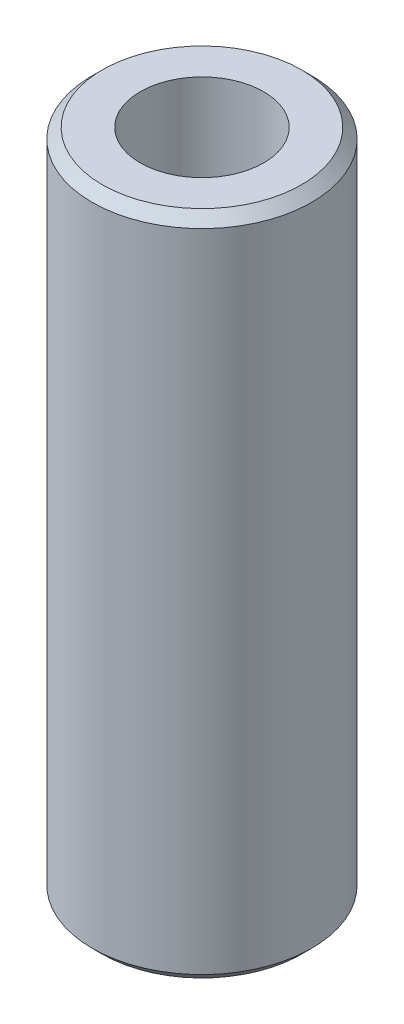
ISO-10303-21;
HEADER;
FILE_DESCRIPTION(('STEP AP214'),'2;1');
FILE_NAME('part.step','',(''),(''),'','','');
FILE_SCHEMA(('AUTOMOTIVE_DESIGN { 1 0 10303 214 1 1 1 1 }'));
ENDSEC;
DATA;
#1=APPLICATION_CONTEXT('core data for automotive mechanical design processes');
#2=APPLICATION_PROTOCOL_DEFINITION('international standard','automotive_design',2000,#1);
#3=PRODUCT_CONTEXT('',#1,'mechanical');
#4=PRODUCT('Part','Part','',(#3));
#5=PRODUCT_RELATED_PRODUCT_CATEGORY('part','',(#4));
#6=PRODUCT_DEFINITION_FORMATION('','',#4);
#7=PRODUCT_DEFINITION_CONTEXT('part definition',#1,'design');
#8=PRODUCT_DEFINITION('design','',#6,#7);
#9=PRODUCT_DEFINITION_SHAPE('','',#8);
#10=(LENGTH_UNIT() NAMED_UNIT(*) SI_UNIT(.MILLI.,.METRE.));
#11=(NAMED_UNIT(*) PLANE_ANGLE_UNIT() SI_UNIT($,.RADIAN.));
#12=(NAMED_UNIT(*) SI_UNIT($,.STERADIAN.) SOLID_ANGLE_UNIT());
#13=UNCERTAINTY_MEASURE_WITH_UNIT(LENGTH_MEASURE(1.E-05),#10,'distance_accuracy_value','');
#14=(GEOMETRIC_REPRESENTATION_CONTEXT(3) GLOBAL_UNCERTAINTY_ASSIGNED_CONTEXT((#13)) GLOBAL_UNIT_ASSIGNED_CONTEXT((#10,
#11,#12)) REPRESENTATION_CONTEXT('',''));
#15=CARTESIAN_POINT('',(0.,0.,0.));
#16=DIRECTION('',(0.,0.,1.));
#17=DIRECTION('',(1.,0.,0.));
#18=AXIS2_PLACEMENT_3D('',#15,#16,#17);
#19=CARTESIAN_POINT('',(0.,288.393077891964,0.));
#20=DIRECTION('',(0.,-1.,0.));
#21=DIRECTION('',(0.,0.,-1.));
#22=AXIS2_PLACEMENT_3D('',#19,#20,#21);
#23=CYLINDRICAL_SURFACE('',#22,47.5);
#24=CARTESIAN_POINT('',(0.,283.997765194955,0.));
#25=DIRECTION('',(0.,1.,0.));
#26=DIRECTION('',(0.,0.,1.));
#27=AXIS2_PLACEMENT_3D('',#24,#25,#26);
#28=CIRCLE('',#27,47.5);
#29=CARTESIAN_POINT('',(0.,283.997765194955,47.5));
#30=VERTEX_POINT('',#29);
#31=EDGE_CURVE('E50',#30,#30,#28,.F.);
#32=ORIENTED_EDGE('',*,*,#31,.T.);
#33=EDGE_LOOP('',(#32));
#34=FACE_BOUND('',#33,.T.);
#35=CARTESIAN_POINT('',(0.,4.39531269700893,0.));
#36=DIRECTION('',(0.,1.,0.));
#37=DIRECTION('',(0.,0.,1.));
#38=AXIS2_PLACEMENT_3D('',#35,#36,#37);
#39=CIRCLE('',#38,47.5);
#40=CARTESIAN_POINT('',(0.,4.39531269700893,47.5));
#41=VERTEX_POINT('',#40);
#42=EDGE_CURVE('E51',#41,#41,#39,.T.);
#43=ORIENTED_EDGE('',*,*,#42,.T.);
#44=EDGE_LOOP('',(#43));
#45=FACE_BOUND('',#44,.T.);
#46=ADVANCED_FACE('F39',(#34,#45),#23,.T.);
#47=CARTESIAN_POINT('',(0.,288.393077891964,0.));
#48=DIRECTION('',(0.,1.,0.));
#49=DIRECTION('',(0.,0.,1.));
#50=AXIS2_PLACEMENT_3D('',#47,#48,#49);
#51=PLANE('',#50);
#52=CARTESIAN_POINT('',(0.,288.393077891964,0.));
#53=DIRECTION('',(0.,1.,0.));
#54=DIRECTION('',(0.,0.,1.));
#55=AXIS2_PLACEMENT_3D('',#52,#53,#54);
#56=CIRCLE('',#55,43.1046873029911);
#57=CARTESIAN_POINT('',(0.,288.393077891964,43.1046873029911));
#58=VERTEX_POINT('',#57);
#59=EDGE_CURVE('E54',#58,#58,#56,.T.);
#60=ORIENTED_EDGE('',*,*,#59,.T.);
#61=EDGE_LOOP('',(#60));
#62=FACE_BOUND('',#61,.T.);
#63=CARTESIAN_POINT('',(0.,288.393077891964,0.));
#64=DIRECTION('',(0.,1.,0.));
#65=DIRECTION('',(0.,0.,1.));
#66=AXIS2_PLACEMENT_3D('',#63,#64,#65);
#67=CIRCLE('',#66,26.7204615402385);
#68=CARTESIAN_POINT('',(0.,288.393077891964,26.7204615402385));
#69=VERTEX_POINT('',#68);
#70=EDGE_CURVE('E58',#69,#69,#67,.T.);
#71=ORIENTED_EDGE('',*,*,#70,.F.);
#72=EDGE_LOOP('',(#71));
#73=FACE_BOUND('',#72,.T.);
#74=ADVANCED_FACE('F69',(#62,#73),#51,.T.);
#75=CARTESIAN_POINT('',(0.,0.,0.));
#76=DIRECTION('',(0.,1.,0.));
#77=DIRECTION('',(0.,0.,1.));
#78=AXIS2_PLACEMENT_3D('',#75,#76,#77);
#79=PLANE('',#78);
#80=CARTESIAN_POINT('',(0.,0.,0.));
#81=DIRECTION('',(0.,1.,0.));
#82=DIRECTION('',(0.,0.,1.));
#83=AXIS2_PLACEMENT_3D('',#80,#81,#82);
#84=CIRCLE('',#83,43.104687302991);
#85=CARTESIAN_POINT('',(0.,0.,43.104687302991));
#86=VERTEX_POINT('',#85);
#87=EDGE_CURVE('E10',#86,#86,#84,.F.);
#88=ORIENTED_EDGE('',*,*,#87,.T.);
#89=EDGE_LOOP('',(#88));
#90=FACE_BOUND('',#89,.T.);
#91=CARTESIAN_POINT('',(0.,0.,0.));
#92=DIRECTION('',(0.,1.,0.));
#93=DIRECTION('',(0.,0.,1.));
#94=AXIS2_PLACEMENT_3D('',#91,#92,#93);
#95=CIRCLE('',#94,26.7204615402385);
#96=CARTESIAN_POINT('',(0.,0.,26.7204615402385));
#97=VERTEX_POINT('',#96);
#98=EDGE_CURVE('E63',#97,#97,#95,.T.);
#99=ORIENTED_EDGE('',*,*,#98,.T.);
#100=EDGE_LOOP('',(#99));
#101=FACE_BOUND('',#100,.T.);
#102=ADVANCED_FACE('F75',(#90,#101),#79,.F.);
#103=CARTESIAN_POINT('',(0.,288.393077891964,0.));
#104=DIRECTION('',(0.,-1.,0.));
#105=DIRECTION('',(0.,0.,-1.));
#106=AXIS2_PLACEMENT_3D('',#103,#104,#105);
#107=CYLINDRICAL_SURFACE('',#106,26.7204615402385);
#108=ORIENTED_EDGE('',*,*,#70,.T.);
#109=EDGE_LOOP('',(#108));
#110=FACE_BOUND('',#109,.T.);
#111=ORIENTED_EDGE('',*,*,#98,.F.);
#112=EDGE_LOOP('',(#111));
#113=FACE_BOUND('',#112,.T.);
#114=ADVANCED_FACE('F70',(#110,#113),#107,.F.);
#115=CARTESIAN_POINT('',(0.,288.393077891964,0.));
#116=DIRECTION('',(0.,-1.,0.));
#117=DIRECTION('',(0.,0.,-1.));
#118=AXIS2_PLACEMENT_3D('',#115,#116,#117);
#119=CONICAL_SURFACE('',#118,43.1046873029911,0.785398163397444);
#120=ORIENTED_EDGE('',*,*,#31,.F.);
#121=EDGE_LOOP('',(#120));
#122=FACE_BOUND('',#121,.T.);
#123=ORIENTED_EDGE('',*,*,#59,.F.);
#124=EDGE_LOOP('',(#123));
#125=FACE_BOUND('',#124,.T.);
#126=ADVANCED_FACE('F81',(#122,#125),#119,.T.);
#127=CARTESIAN_POINT('',(0.,4.39531269700893,0.));
#128=DIRECTION('',(0.,1.,0.));
#129=DIRECTION('',(0.,0.,1.));
#130=AXIS2_PLACEMENT_3D('',#127,#128,#129);
#131=CONICAL_SURFACE('',#130,47.5,0.785398163397454);
#132=CARTESIAN_POINT('',(0.,0.,43.104687302991));
#133=CARTESIAN_POINT('',(0.,0.0457845072605108,43.1504718102515));
#134=CARTESIAN_POINT('',(0.,0.0915690145210199,43.196256317512));
#135=CARTESIAN_POINT('',(0.,0.183138029042038,43.2878253320331));
#136=CARTESIAN_POINT('',(0.,0.228922536302547,43.3336098392936));
#137=CARTESIAN_POINT('',(0.,0.320491550823567,43.4251788538146));
#138=CARTESIAN_POINT('',(0.,0.366276058084078,43.4709633610751));
#139=CARTESIAN_POINT('',(0.,0.457845072605097,43.5625323755961));
#140=CARTESIAN_POINT('',(0.,0.503629579865605,43.6083168828566));
#141=CARTESIAN_POINT('',(0.,0.595198594386625,43.6998858973777));
#142=CARTESIAN_POINT('',(0.,0.640983101647136,43.7456704046382));
#143=CARTESIAN_POINT('',(0.,0.732552116168155,43.8372394191592));
#144=CARTESIAN_POINT('',(0.,0.778336623428664,43.8830239264197));
#145=CARTESIAN_POINT('',(0.,0.869905637949683,43.9745929409407));
#146=CARTESIAN_POINT('',(0.,0.915690145210194,44.0203774482012));
#147=CARTESIAN_POINT('',(0.,1.00725915973121,44.1119464627223));
#148=CARTESIAN_POINT('',(0.,1.05304366699172,44.1577309699828));
#149=CARTESIAN_POINT('',(0.,1.14461268151274,44.2492999845038));
#150=CARTESIAN_POINT('',(0.,1.19039718877325,44.2950844917643));
#151=CARTESIAN_POINT('',(0.,1.28196620329427,44.3866535062853));
#152=CARTESIAN_POINT('',(0.,1.32775071055478,44.4324380135458));
#153=CARTESIAN_POINT('',(0.,1.4193197250758,44.5240070280668));
#154=CARTESIAN_POINT('',(0.,1.46510423233631,44.5697915353273));
#155=CARTESIAN_POINT('',(0.,1.55667324685733,44.6613605498484));
#156=CARTESIAN_POINT('',(0.,1.60245775411784,44.7071450571089));
#157=CARTESIAN_POINT('',(0.,1.69402676863886,44.7987140716299));
#158=CARTESIAN_POINT('',(0.,1.73981127589937,44.8444985788904));
#159=CARTESIAN_POINT('',(0.,1.83138029042039,44.9360675934114));
#160=CARTESIAN_POINT('',(0.,1.8771647976809,44.9818521006719));
#161=CARTESIAN_POINT('',(0.,1.96873381220192,45.073421115193));
#162=CARTESIAN_POINT('',(0.,2.01451831946243,45.1192056224535));
#163=CARTESIAN_POINT('',(0.,2.10608733398345,45.2107746369745));
#164=CARTESIAN_POINT('',(0.,2.15187184124396,45.256559144235));
#165=CARTESIAN_POINT('',(0.,2.24344085576498,45.348128158756));
#166=CARTESIAN_POINT('',(0.,2.28922536302549,45.3939126660165));
#167=CARTESIAN_POINT('',(0.,2.38079437754651,45.4854816805376));
#168=CARTESIAN_POINT('',(0.,2.42657888480702,45.5312661877981));
#169=CARTESIAN_POINT('',(0.,2.51814789932804,45.6228352023191));
#170=CARTESIAN_POINT('',(0.,2.56393240658854,45.6686197095796));
#171=CARTESIAN_POINT('',(0.,2.65550142110956,45.7601887241006));
#172=CARTESIAN_POINT('',(0.,2.70128592837007,45.8059732313611));
#173=CARTESIAN_POINT('',(0.,2.79285494289109,45.8975422458821));
#174=CARTESIAN_POINT('',(0.,2.8386394501516,45.9433267531427));
#175=CARTESIAN_POINT('',(0.,2.93020846467262,46.0348957676637));
#176=CARTESIAN_POINT('',(0.,2.97599297193313,46.0806802749242));
#177=CARTESIAN_POINT('',(0.,3.06756198645415,46.1722492894452));
#178=CARTESIAN_POINT('',(0.,3.11334649371466,46.2180337967057));
#179=CARTESIAN_POINT('',(0.,3.20491550823568,46.3096028112267));
#180=CARTESIAN_POINT('',(0.,3.25070001549619,46.3553873184872));
#181=CARTESIAN_POINT('',(0.,3.34226903001721,46.4469563330083));
#182=CARTESIAN_POINT('',(0.,3.38805353727772,46.4927408402688));
#183=CARTESIAN_POINT('',(0.,3.47962255179874,46.5843098547898));
#184=CARTESIAN_POINT('',(0.,3.52540705905925,46.6300943620503));
#185=CARTESIAN_POINT('',(0.,3.61697607358027,46.7216633765713));
#186=CARTESIAN_POINT('',(0.,3.66276058084078,46.7674478838318));
#187=CARTESIAN_POINT('',(0.,3.7543295953618,46.8590168983529));
#188=CARTESIAN_POINT('',(0.,3.80011410262231,46.9048014056134));
#189=CARTESIAN_POINT('',(0.,3.89168311714333,46.9963704201344));
#190=CARTESIAN_POINT('',(0.,3.93746762440384,47.0421549273949));
#191=CARTESIAN_POINT('',(0.,4.02903663892486,47.1337239419159));
#192=CARTESIAN_POINT('',(0.,4.07482114618537,47.1795084491764));
#193=CARTESIAN_POINT('',(0.,4.16639016070638,47.2710774636975));
#194=CARTESIAN_POINT('',(0.,4.2121746679669,47.316861970958));
#195=CARTESIAN_POINT('',(0.,4.30374368248792,47.408430985479));
#196=CARTESIAN_POINT('',(0.,4.34952818974843,47.4542154927395));
#197=CARTESIAN_POINT('',(0.,4.39531269700893,47.5));
#198=B_SPLINE_CURVE_WITH_KNOTS('',3,(#132,#133,#134,#135,#136,#137,#138,#139,#140,#141,#142,
#143,#144,#145,#146,#147,#148,#149,#150,#151,#152,#153,#154,#155,#156,#157,#158,#159,#160,#161,
#162,#163,#164,#165,#166,#167,#168,#169,#170,#171,#172,#173,#174,#175,#176,#177,#178,#179,#180,
#181,#182,#183,#184,#185,#186,#187,#188,#189,#190,#191,#192,#193,#194,#195,#196,#197),
.UNSPECIFIED.,.F.,.F.,(4,2,2,2,2,2,2,2,2,2,2,2,2,2,2,2,2,2,2,2,2,2,2,2,2,2,2,2,2,2,2,2,4),(0.,
0.194247213343146,0.388494426686296,0.582741640029442,0.776988853372592,0.971236066715738,
1.16548328005889,1.35973049340203,1.55397770674519,1.74822492008833,1.94247213343148,
2.13671934677463,2.33096656011778,2.52521377346092,2.71946098680407,2.91370820014722,
3.10795541349037,3.30220262683352,3.49644984017666,3.69069705351981,3.88494426686296,
4.07919148020611,4.27343869354926,4.46768590689241,4.66193312023555,4.8561803335787,
5.05042754692185,5.244674760265,5.43892197360814,5.63316918695129,5.82741640029444,
6.02166361363759,6.21591082698074),.UNSPECIFIED.);
#199=EDGE_CURVE('BSEAM45',#86,#41,#198,.T.);
#200=ORIENTED_EDGE('',*,*,#87,.F.);
#201=ORIENTED_EDGE('',*,*,#42,.F.);
#202=ORIENTED_EDGE('',*,*,#199,.T.);
#203=ORIENTED_EDGE('',*,*,#199,.F.);
#204=EDGE_LOOP('',(#200,#202,#201,#203));
#205=FACE_BOUND('',#204,.T.);
#206=ADVANCED_FACE('F45',(#205),#131,.T.);
#207=CLOSED_SHELL('',(#46,#74,#102,#114,#126,#206));
#208=MANIFOLD_SOLID_BREP('B2',#207);
#209=ADVANCED_BREP_SHAPE_REPRESENTATION('',(#18,#208),#14);
#210=SHAPE_DEFINITION_REPRESENTATION(#9,#209);
ENDSEC;
END-ISO-10303-21;
